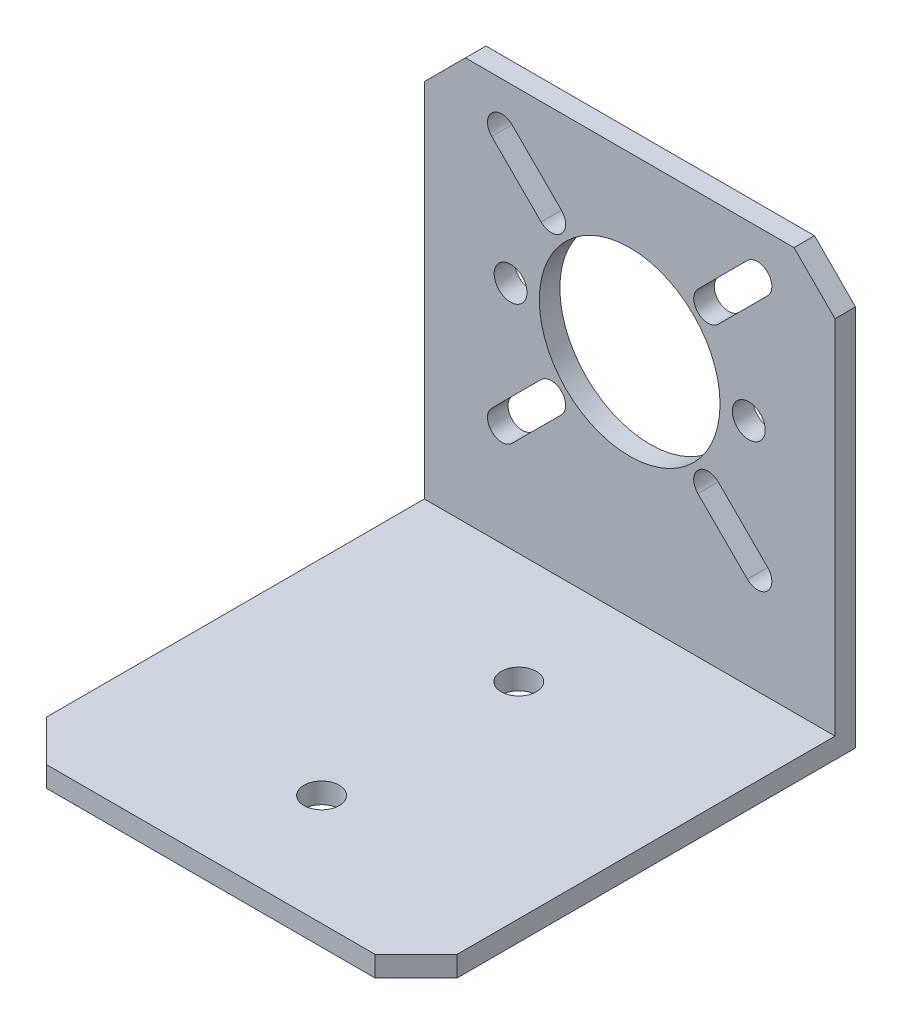
ISO-10303-21;
HEADER;
FILE_DESCRIPTION(('STEP AP214'),'2;1');
FILE_NAME('part.step','',(''),(''),'','','');
FILE_SCHEMA(('AUTOMOTIVE_DESIGN { 1 0 10303 214 1 1 1 1 }'));
ENDSEC;
DATA;
#1=APPLICATION_CONTEXT('core data for automotive mechanical design processes');
#2=APPLICATION_PROTOCOL_DEFINITION('international standard','automotive_design',2000,#1);
#3=PRODUCT_CONTEXT('',#1,'mechanical');
#4=PRODUCT('Part','Part','',(#3));
#5=PRODUCT_RELATED_PRODUCT_CATEGORY('part','',(#4));
#6=PRODUCT_DEFINITION_FORMATION('','',#4);
#7=PRODUCT_DEFINITION_CONTEXT('part definition',#1,'design');
#8=PRODUCT_DEFINITION('design','',#6,#7);
#9=PRODUCT_DEFINITION_SHAPE('','',#8);
#10=(LENGTH_UNIT() NAMED_UNIT(*) SI_UNIT(.MILLI.,.METRE.));
#11=(NAMED_UNIT(*) PLANE_ANGLE_UNIT() SI_UNIT($,.RADIAN.));
#12=(NAMED_UNIT(*) SI_UNIT($,.STERADIAN.) SOLID_ANGLE_UNIT());
#13=UNCERTAINTY_MEASURE_WITH_UNIT(LENGTH_MEASURE(1.E-05),#10,'distance_accuracy_value','');
#14=(GEOMETRIC_REPRESENTATION_CONTEXT(3) GLOBAL_UNCERTAINTY_ASSIGNED_CONTEXT((#13)) GLOBAL_UNIT_ASSIGNED_CONTEXT((#10,
#11,#12)) REPRESENTATION_CONTEXT('',''));
#15=CARTESIAN_POINT('',(0.,0.,0.));
#16=DIRECTION('',(0.,0.,1.));
#17=DIRECTION('',(1.,0.,0.));
#18=AXIS2_PLACEMENT_3D('',#15,#16,#17);
#19=CARTESIAN_POINT('',(0.,0.,2.5));
#20=DIRECTION('',(0.,0.,1.));
#21=DIRECTION('',(1.,0.,0.));
#22=AXIS2_PLACEMENT_3D('',#19,#20,#21);
#23=PLANE('',#22);
#24=DIRECTION('',(-1.,0.,0.));
#25=VECTOR('',#24,1.);
#26=CARTESIAN_POINT('',(-25.,25.75,2.5));
#27=LINE('',#26,#25);
#28=CARTESIAN_POINT('',(20.,25.75,2.5));
#29=VERTEX_POINT('',#28);
#30=CARTESIAN_POINT('',(-20.,25.75,2.5));
#31=VERTEX_POINT('',#30);
#32=EDGE_CURVE('E234',#29,#31,#27,.T.);
#33=ORIENTED_EDGE('',*,*,#32,.T.);
#34=DIRECTION('',(0.707106781186549,0.707106781186546,0.));
#35=VECTOR('',#34,1.);
#36=CARTESIAN_POINT('',(-22.8749999999999,22.8750000000001,2.5));
#37=LINE('',#36,#35);
#38=CARTESIAN_POINT('',(-25.,20.75,2.5));
#39=VERTEX_POINT('',#38);
#40=EDGE_CURVE('E228',#31,#39,#37,.F.);
#41=ORIENTED_EDGE('',*,*,#40,.T.);
#42=DIRECTION('',(0.,-1.,0.));
#43=VECTOR('',#42,1.);
#44=CARTESIAN_POINT('',(-25.,25.75,2.5));
#45=LINE('',#44,#43);
#46=CARTESIAN_POINT('',(-25.,-23.25,2.5));
#47=VERTEX_POINT('',#46);
#48=EDGE_CURVE('E219',#39,#47,#45,.T.);
#49=ORIENTED_EDGE('',*,*,#48,.T.);
#50=DIRECTION('',(-1.,0.,0.));
#51=VECTOR('',#50,1.);
#52=CARTESIAN_POINT('',(-25.,-23.25,2.5));
#53=LINE('',#52,#51);
#54=CARTESIAN_POINT('',(25.,-23.25,2.5));
#55=VERTEX_POINT('',#54);
#56=EDGE_CURVE('E225',#55,#47,#53,.T.);
#57=ORIENTED_EDGE('',*,*,#56,.F.);
#58=DIRECTION('',(0.,1.,0.));
#59=VECTOR('',#58,1.);
#60=CARTESIAN_POINT('',(25.,25.75,2.5));
#61=LINE('',#60,#59);
#62=CARTESIAN_POINT('',(25.,20.75,2.5));
#63=VERTEX_POINT('',#62);
#64=EDGE_CURVE('E461',#55,#63,#61,.T.);
#65=ORIENTED_EDGE('',*,*,#64,.T.);
#66=DIRECTION('',(0.707106781186547,-0.707106781186549,0.));
#67=VECTOR('',#66,1.);
#68=CARTESIAN_POINT('',(22.875,22.875,2.5));
#69=LINE('',#68,#67);
#70=EDGE_CURVE('E504',#63,#29,#69,.F.);
#71=ORIENTED_EDGE('',*,*,#70,.T.);
#72=EDGE_LOOP('',(#33,#41,#49,#57,#65,#71));
#73=FACE_BOUND('',#72,.T.);
#74=CARTESIAN_POINT('',(-14.5,4.74999999999999,2.5));
#75=DIRECTION('',(0.,0.,1.));
#76=DIRECTION('',(1.,0.,0.));
#77=AXIS2_PLACEMENT_3D('',#74,#75,#76);
#78=CIRCLE('',#77,2.);
#79=CARTESIAN_POINT('',(-12.5,4.74999999999999,2.5));
#80=VERTEX_POINT('',#79);
#81=EDGE_CURVE('E445',#80,#80,#78,.T.);
#82=ORIENTED_EDGE('',*,*,#81,.F.);
#83=EDGE_LOOP('',(#82));
#84=FACE_BOUND('',#83,.T.);
#85=CARTESIAN_POINT('',(0.,4.75,2.5));
#86=DIRECTION('',(0.,0.,1.));
#87=DIRECTION('',(1.,0.,0.));
#88=AXIS2_PLACEMENT_3D('',#85,#86,#87);
#89=CIRCLE('',#88,11.);
#90=CARTESIAN_POINT('',(11.,4.75,2.5));
#91=VERTEX_POINT('',#90);
#92=EDGE_CURVE('E453',#91,#91,#89,.T.);
#93=ORIENTED_EDGE('',*,*,#92,.F.);
#94=EDGE_LOOP('',(#93));
#95=FACE_BOUND('',#94,.T.);
#96=CARTESIAN_POINT('',(14.5,4.75,2.5));
#97=DIRECTION('',(0.,0.,1.));
#98=DIRECTION('',(1.,0.,0.));
#99=AXIS2_PLACEMENT_3D('',#96,#97,#98);
#100=CIRCLE('',#99,2.);
#101=CARTESIAN_POINT('',(16.5,4.75,2.5));
#102=VERTEX_POINT('',#101);
#103=EDGE_CURVE('E437',#102,#102,#100,.T.);
#104=ORIENTED_EDGE('',*,*,#103,.F.);
#105=EDGE_LOOP('',(#104));
#106=FACE_BOUND('',#105,.T.);
#107=DIRECTION('',(0.707106781186553,-0.707106781186542,0.));
#108=VECTOR('',#107,1.);
#109=CARTESIAN_POINT('',(-16.7937860531806,19.0689123190275,2.5));
#110=LINE('',#109,#108);
#111=CARTESIAN_POINT('',(-16.7937860531806,19.0689123190275,2.5));
#112=VERTEX_POINT('',#111);
#113=CARTESIAN_POINT('',(-10.7833784130949,13.0585046789419,2.5));
#114=VERTEX_POINT('',#113);
#115=EDGE_CURVE('E397',#112,#114,#110,.T.);
#116=ORIENTED_EDGE('',*,*,#115,.F.);
#117=CARTESIAN_POINT('',(-15.5563491861041,20.306349186104,2.5));
#118=DIRECTION('',(0.,0.,1.));
#119=DIRECTION('',(1.,0.,0.));
#120=AXIS2_PLACEMENT_3D('',#117,#118,#119);
#121=CIRCLE('',#120,1.74999999999998);
#122=CARTESIAN_POINT('',(-14.3189123190277,21.5437860531804,2.5));
#123=VERTEX_POINT('',#122);
#124=EDGE_CURVE('E394',#123,#112,#121,.T.);
#125=ORIENTED_EDGE('',*,*,#124,.F.);
#126=DIRECTION('',(-0.707106781186551,0.707106781186544,0.));
#127=VECTOR('',#126,1.);
#128=CARTESIAN_POINT('',(-14.3189123190277,21.5437860531804,2.5));
#129=LINE('',#128,#127);
#130=CARTESIAN_POINT('',(-8.30850467894202,15.5333784130948,2.5));
#131=VERTEX_POINT('',#130);
#132=EDGE_CURVE('E405',#131,#123,#129,.T.);
#133=ORIENTED_EDGE('',*,*,#132,.F.);
#134=CARTESIAN_POINT('',(-9.54594154601844,14.2959415460183,2.5));
#135=DIRECTION('',(0.,0.,1.));
#136=DIRECTION('',(1.,0.,0.));
#137=AXIS2_PLACEMENT_3D('',#134,#135,#136);
#138=CIRCLE('',#137,1.74999999999997);
#139=EDGE_CURVE('E401',#114,#131,#138,.T.);
#140=ORIENTED_EDGE('',*,*,#139,.F.);
#141=EDGE_LOOP('',(#116,#125,#133,#140));
#142=FACE_BOUND('',#141,.T.);
#143=DIRECTION('',(-0.70710678118655,-0.707106781186545,0.));
#144=VECTOR('',#143,1.);
#145=CARTESIAN_POINT('',(14.3189123190277,21.5437860531804,2.5));
#146=LINE('',#145,#144);
#147=CARTESIAN_POINT('',(14.3189123190277,21.5437860531804,2.5));
#148=VERTEX_POINT('',#147);
#149=CARTESIAN_POINT('',(8.30850467894203,15.5333784130948,2.5));
#150=VERTEX_POINT('',#149);
#151=EDGE_CURVE('E354',#148,#150,#146,.T.);
#152=ORIENTED_EDGE('',*,*,#151,.F.);
#153=CARTESIAN_POINT('',(15.5563491861041,20.306349186104,2.5));
#154=DIRECTION('',(0.,0.,1.));
#155=DIRECTION('',(-1.,0.,0.));
#156=AXIS2_PLACEMENT_3D('',#153,#154,#155);
#157=CIRCLE('',#156,1.74999999999998);
#158=CARTESIAN_POINT('',(16.7937860531806,19.0689123190275,2.5));
#159=VERTEX_POINT('',#158);
#160=EDGE_CURVE('E351',#159,#148,#157,.T.);
#161=ORIENTED_EDGE('',*,*,#160,.F.);
#162=DIRECTION('',(0.707106781186552,0.707106781186543,0.));
#163=VECTOR('',#162,1.);
#164=CARTESIAN_POINT('',(16.7937860531806,19.0689123190275,2.5));
#165=LINE('',#164,#163);
#166=CARTESIAN_POINT('',(10.7833784130949,13.0585046789419,2.5));
#167=VERTEX_POINT('',#166);
#168=EDGE_CURVE('E362',#167,#159,#165,.T.);
#169=ORIENTED_EDGE('',*,*,#168,.F.);
#170=CARTESIAN_POINT('',(9.54594154601845,14.2959415460183,2.5));
#171=DIRECTION('',(0.,0.,1.));
#172=DIRECTION('',(-1.,0.,0.));
#173=AXIS2_PLACEMENT_3D('',#170,#171,#172);
#174=CIRCLE('',#173,1.74999999999997);
#175=EDGE_CURVE('E358',#150,#167,#174,.T.);
#176=ORIENTED_EDGE('',*,*,#175,.F.);
#177=EDGE_LOOP('',(#152,#161,#169,#176));
#178=FACE_BOUND('',#177,.T.);
#179=DIRECTION('',(0.707106781186551,0.707106781186544,0.));
#180=VECTOR('',#179,1.);
#181=CARTESIAN_POINT('',(-14.3189123190277,-12.0437860531804,2.5));
#182=LINE('',#181,#180);
#183=CARTESIAN_POINT('',(-14.3189123190277,-12.0437860531804,2.5));
#184=VERTEX_POINT('',#183);
#185=CARTESIAN_POINT('',(-8.30850467894202,-6.03337841309478,2.5));
#186=VERTEX_POINT('',#185);
#187=EDGE_CURVE('E311',#184,#186,#182,.T.);
#188=ORIENTED_EDGE('',*,*,#187,.F.);
#189=CARTESIAN_POINT('',(-15.5563491861041,-10.806349186104,2.5));
#190=DIRECTION('',(0.,0.,1.));
#191=DIRECTION('',(-1.,0.,0.));
#192=AXIS2_PLACEMENT_3D('',#189,#190,#191);
#193=CIRCLE('',#192,1.74999999999998);
#194=CARTESIAN_POINT('',(-16.7937860531806,-9.56891231902749,2.5));
#195=VERTEX_POINT('',#194);
#196=EDGE_CURVE('E308',#195,#184,#193,.T.);
#197=ORIENTED_EDGE('',*,*,#196,.F.);
#198=DIRECTION('',(-0.707106781186553,-0.707106781186542,0.));
#199=VECTOR('',#198,1.);
#200=CARTESIAN_POINT('',(-16.7937860531806,-9.56891231902749,2.5));
#201=LINE('',#200,#199);
#202=CARTESIAN_POINT('',(-10.7833784130949,-3.55850467894189,2.5));
#203=VERTEX_POINT('',#202);
#204=EDGE_CURVE('E319',#203,#195,#201,.T.);
#205=ORIENTED_EDGE('',*,*,#204,.F.);
#206=CARTESIAN_POINT('',(-9.54594154601844,-4.79594154601834,2.5));
#207=DIRECTION('',(0.,0.,1.));
#208=DIRECTION('',(-1.,0.,0.));
#209=AXIS2_PLACEMENT_3D('',#206,#207,#208);
#210=CIRCLE('',#209,1.74999999999997);
#211=EDGE_CURVE('E315',#186,#203,#210,.T.);
#212=ORIENTED_EDGE('',*,*,#211,.F.);
#213=EDGE_LOOP('',(#188,#197,#205,#212));
#214=FACE_BOUND('',#213,.T.);
#215=DIRECTION('',(-0.707106781186552,0.707106781186543,0.));
#216=VECTOR('',#215,1.);
#217=CARTESIAN_POINT('',(16.7937860531806,-9.5689123190275,2.5));
#218=LINE('',#217,#216);
#219=CARTESIAN_POINT('',(16.7937860531806,-9.5689123190275,2.5));
#220=VERTEX_POINT('',#219);
#221=CARTESIAN_POINT('',(10.7833784130949,-3.55850467894189,2.5));
#222=VERTEX_POINT('',#221);
#223=EDGE_CURVE('E268',#220,#222,#218,.T.);
#224=ORIENTED_EDGE('',*,*,#223,.F.);
#225=CARTESIAN_POINT('',(15.5563491861041,-10.806349186104,2.5));
#226=DIRECTION('',(0.,0.,1.));
#227=DIRECTION('',(1.,0.,0.));
#228=AXIS2_PLACEMENT_3D('',#225,#226,#227);
#229=CIRCLE('',#228,1.74999999999998);
#230=CARTESIAN_POINT('',(14.3189123190277,-12.0437860531804,2.5));
#231=VERTEX_POINT('',#230);
#232=EDGE_CURVE('E265',#231,#220,#229,.T.);
#233=ORIENTED_EDGE('',*,*,#232,.F.);
#234=DIRECTION('',(0.70710678118655,-0.707106781186545,0.));
#235=VECTOR('',#234,1.);
#236=CARTESIAN_POINT('',(14.3189123190277,-12.0437860531804,2.5));
#237=LINE('',#236,#235);
#238=CARTESIAN_POINT('',(8.30850467894203,-6.03337841309478,2.5));
#239=VERTEX_POINT('',#238);
#240=EDGE_CURVE('E276',#239,#231,#237,.T.);
#241=ORIENTED_EDGE('',*,*,#240,.F.);
#242=CARTESIAN_POINT('',(9.54594154601845,-4.79594154601834,2.5));
#243=DIRECTION('',(0.,0.,1.));
#244=DIRECTION('',(1.,0.,0.));
#245=AXIS2_PLACEMENT_3D('',#242,#243,#244);
#246=CIRCLE('',#245,1.74999999999997);
#247=EDGE_CURVE('E272',#222,#239,#246,.T.);
#248=ORIENTED_EDGE('',*,*,#247,.F.);
#249=EDGE_LOOP('',(#224,#233,#241,#248));
#250=FACE_BOUND('',#249,.T.);
#251=ADVANCED_FACE('F43',(#73,#84,#95,#106,#142,#178,#214,#250),#23,.T.);
#252=CARTESIAN_POINT('',(0.,0.,0.));
#253=DIRECTION('',(0.,0.,1.));
#254=DIRECTION('',(1.,0.,0.));
#255=AXIS2_PLACEMENT_3D('',#252,#253,#254);
#256=PLANE('',#255);
#257=CARTESIAN_POINT('',(-15.5563491861041,-10.806349186104,0.));
#258=DIRECTION('',(0.,0.,1.));
#259=DIRECTION('',(-1.,0.,0.));
#260=AXIS2_PLACEMENT_3D('',#257,#258,#259);
#261=CIRCLE('',#260,1.74999999999998);
#262=CARTESIAN_POINT('',(-16.7937860531806,-9.56891231902749,0.));
#263=VERTEX_POINT('',#262);
#264=CARTESIAN_POINT('',(-14.3189123190277,-12.0437860531804,0.));
#265=VERTEX_POINT('',#264);
#266=EDGE_CURVE('E307',#263,#265,#261,.T.);
#267=ORIENTED_EDGE('',*,*,#266,.T.);
#268=DIRECTION('',(0.707106781186551,0.707106781186544,0.));
#269=VECTOR('',#268,1.);
#270=CARTESIAN_POINT('',(-14.3189123190277,-12.0437860531804,0.));
#271=LINE('',#270,#269);
#272=CARTESIAN_POINT('',(-8.30850467894202,-6.03337841309478,0.));
#273=VERTEX_POINT('',#272);
#274=EDGE_CURVE('E326',#265,#273,#271,.T.);
#275=ORIENTED_EDGE('',*,*,#274,.T.);
#276=CARTESIAN_POINT('',(-9.54594154601844,-4.79594154601834,0.));
#277=DIRECTION('',(0.,0.,1.));
#278=DIRECTION('',(-1.,0.,0.));
#279=AXIS2_PLACEMENT_3D('',#276,#277,#278);
#280=CIRCLE('',#279,1.74999999999997);
#281=CARTESIAN_POINT('',(-10.7833784130949,-3.55850467894189,0.));
#282=VERTEX_POINT('',#281);
#283=EDGE_CURVE('E330',#273,#282,#280,.T.);
#284=ORIENTED_EDGE('',*,*,#283,.T.);
#285=DIRECTION('',(-0.707106781186553,-0.707106781186542,0.));
#286=VECTOR('',#285,1.);
#287=CARTESIAN_POINT('',(-16.7937860531806,-9.56891231902749,0.));
#288=LINE('',#287,#286);
#289=EDGE_CURVE('E312',#282,#263,#288,.T.);
#290=ORIENTED_EDGE('',*,*,#289,.T.);
#291=EDGE_LOOP('',(#267,#275,#284,#290));
#292=FACE_BOUND('',#291,.T.);
#293=CARTESIAN_POINT('',(-15.5563491861041,20.306349186104,0.));
#294=DIRECTION('',(0.,0.,1.));
#295=DIRECTION('',(1.,0.,0.));
#296=AXIS2_PLACEMENT_3D('',#293,#294,#295);
#297=CIRCLE('',#296,1.74999999999998);
#298=CARTESIAN_POINT('',(-14.3189123190277,21.5437860531804,0.));
#299=VERTEX_POINT('',#298);
#300=CARTESIAN_POINT('',(-16.7937860531806,19.0689123190275,0.));
#301=VERTEX_POINT('',#300);
#302=EDGE_CURVE('E393',#299,#301,#297,.T.);
#303=ORIENTED_EDGE('',*,*,#302,.T.);
#304=DIRECTION('',(0.707106781186553,-0.707106781186542,0.));
#305=VECTOR('',#304,1.);
#306=CARTESIAN_POINT('',(-16.7937860531806,19.0689123190275,0.));
#307=LINE('',#306,#305);
#308=CARTESIAN_POINT('',(-10.7833784130949,13.0585046789419,0.));
#309=VERTEX_POINT('',#308);
#310=EDGE_CURVE('E412',#301,#309,#307,.T.);
#311=ORIENTED_EDGE('',*,*,#310,.T.);
#312=CARTESIAN_POINT('',(-9.54594154601844,14.2959415460183,0.));
#313=DIRECTION('',(0.,0.,1.));
#314=DIRECTION('',(1.,0.,0.));
#315=AXIS2_PLACEMENT_3D('',#312,#313,#314);
#316=CIRCLE('',#315,1.74999999999997);
#317=CARTESIAN_POINT('',(-8.30850467894202,15.5333784130948,0.));
#318=VERTEX_POINT('',#317);
#319=EDGE_CURVE('E416',#309,#318,#316,.T.);
#320=ORIENTED_EDGE('',*,*,#319,.T.);
#321=DIRECTION('',(-0.707106781186551,0.707106781186544,0.));
#322=VECTOR('',#321,1.);
#323=CARTESIAN_POINT('',(-14.3189123190277,21.5437860531804,0.));
#324=LINE('',#323,#322);
#325=EDGE_CURVE('E398',#318,#299,#324,.T.);
#326=ORIENTED_EDGE('',*,*,#325,.T.);
#327=EDGE_LOOP('',(#303,#311,#320,#326));
#328=FACE_BOUND('',#327,.T.);
#329=DIRECTION('',(0.,-1.,0.));
#330=VECTOR('',#329,1.);
#331=CARTESIAN_POINT('',(-25.,25.75,0.));
#332=LINE('',#331,#330);
#333=CARTESIAN_POINT('',(-25.,20.75,0.));
#334=VERTEX_POINT('',#333);
#335=CARTESIAN_POINT('',(-25.,-25.75,0.));
#336=VERTEX_POINT('',#335);
#337=EDGE_CURVE('E474',#334,#336,#332,.T.);
#338=ORIENTED_EDGE('',*,*,#337,.F.);
#339=DIRECTION('',(-0.707106781186549,-0.707106781186546,0.));
#340=VECTOR('',#339,1.);
#341=CARTESIAN_POINT('',(-25.,20.75,0.));
#342=LINE('',#341,#340);
#343=CARTESIAN_POINT('',(-20.,25.75,0.));
#344=VERTEX_POINT('',#343);
#345=EDGE_CURVE('E494',#334,#344,#342,.F.);
#346=ORIENTED_EDGE('',*,*,#345,.T.);
#347=DIRECTION('',(-1.,0.,0.));
#348=VECTOR('',#347,1.);
#349=CARTESIAN_POINT('',(-25.,25.75,0.));
#350=LINE('',#349,#348);
#351=CARTESIAN_POINT('',(20.,25.75,0.));
#352=VERTEX_POINT('',#351);
#353=EDGE_CURVE('E470',#352,#344,#350,.T.);
#354=ORIENTED_EDGE('',*,*,#353,.F.);
#355=DIRECTION('',(-0.707106781186547,0.707106781186549,0.));
#356=VECTOR('',#355,1.);
#357=CARTESIAN_POINT('',(20.,25.75,0.));
#358=LINE('',#357,#356);
#359=CARTESIAN_POINT('',(25.,20.75,0.));
#360=VERTEX_POINT('',#359);
#361=EDGE_CURVE('E491',#352,#360,#358,.F.);
#362=ORIENTED_EDGE('',*,*,#361,.T.);
#363=DIRECTION('',(0.,1.,0.));
#364=VECTOR('',#363,1.);
#365=CARTESIAN_POINT('',(25.,25.75,0.));
#366=LINE('',#365,#364);
#367=CARTESIAN_POINT('',(25.,-25.75,0.));
#368=VERTEX_POINT('',#367);
#369=EDGE_CURVE('E457',#368,#360,#366,.T.);
#370=ORIENTED_EDGE('',*,*,#369,.F.);
#371=DIRECTION('',(1.,0.,0.));
#372=VECTOR('',#371,1.);
#373=CARTESIAN_POINT('',(-25.,-25.75,0.));
#374=LINE('',#373,#372);
#375=EDGE_CURVE('E464',#336,#368,#374,.T.);
#376=ORIENTED_EDGE('',*,*,#375,.F.);
#377=EDGE_LOOP('',(#338,#346,#354,#362,#370,#376));
#378=FACE_BOUND('',#377,.T.);
#379=CARTESIAN_POINT('',(0.,4.75,0.));
#380=DIRECTION('',(0.,0.,1.));
#381=DIRECTION('',(1.,0.,0.));
#382=AXIS2_PLACEMENT_3D('',#379,#380,#381);
#383=CIRCLE('',#382,11.);
#384=CARTESIAN_POINT('',(11.,4.75,0.));
#385=VERTEX_POINT('',#384);
#386=EDGE_CURVE('E449',#385,#385,#383,.T.);
#387=ORIENTED_EDGE('',*,*,#386,.T.);
#388=EDGE_LOOP('',(#387));
#389=FACE_BOUND('',#388,.T.);
#390=CARTESIAN_POINT('',(-14.5,4.74999999999999,0.));
#391=DIRECTION('',(0.,0.,1.));
#392=DIRECTION('',(1.,0.,0.));
#393=AXIS2_PLACEMENT_3D('',#390,#391,#392);
#394=CIRCLE('',#393,2.);
#395=CARTESIAN_POINT('',(-12.5,4.74999999999999,0.));
#396=VERTEX_POINT('',#395);
#397=EDGE_CURVE('E441',#396,#396,#394,.T.);
#398=ORIENTED_EDGE('',*,*,#397,.T.);
#399=EDGE_LOOP('',(#398));
#400=FACE_BOUND('',#399,.T.);
#401=CARTESIAN_POINT('',(14.5,4.75,0.));
#402=DIRECTION('',(0.,0.,1.));
#403=DIRECTION('',(1.,0.,0.));
#404=AXIS2_PLACEMENT_3D('',#401,#402,#403);
#405=CIRCLE('',#404,2.);
#406=CARTESIAN_POINT('',(16.5,4.75,0.));
#407=VERTEX_POINT('',#406);
#408=EDGE_CURVE('E436',#407,#407,#405,.T.);
#409=ORIENTED_EDGE('',*,*,#408,.T.);
#410=EDGE_LOOP('',(#409));
#411=FACE_BOUND('',#410,.T.);
#412=CARTESIAN_POINT('',(15.5563491861041,20.306349186104,0.));
#413=DIRECTION('',(0.,0.,1.));
#414=DIRECTION('',(-1.,0.,0.));
#415=AXIS2_PLACEMENT_3D('',#412,#413,#414);
#416=CIRCLE('',#415,1.74999999999998);
#417=CARTESIAN_POINT('',(16.7937860531806,19.0689123190275,0.));
#418=VERTEX_POINT('',#417);
#419=CARTESIAN_POINT('',(14.3189123190277,21.5437860531804,0.));
#420=VERTEX_POINT('',#419);
#421=EDGE_CURVE('E350',#418,#420,#416,.T.);
#422=ORIENTED_EDGE('',*,*,#421,.T.);
#423=DIRECTION('',(-0.70710678118655,-0.707106781186545,0.));
#424=VECTOR('',#423,1.);
#425=CARTESIAN_POINT('',(14.3189123190277,21.5437860531804,0.));
#426=LINE('',#425,#424);
#427=CARTESIAN_POINT('',(8.30850467894203,15.5333784130948,0.));
#428=VERTEX_POINT('',#427);
#429=EDGE_CURVE('E369',#420,#428,#426,.T.);
#430=ORIENTED_EDGE('',*,*,#429,.T.);
#431=CARTESIAN_POINT('',(9.54594154601845,14.2959415460183,0.));
#432=DIRECTION('',(0.,0.,1.));
#433=DIRECTION('',(-1.,0.,0.));
#434=AXIS2_PLACEMENT_3D('',#431,#432,#433);
#435=CIRCLE('',#434,1.74999999999997);
#436=CARTESIAN_POINT('',(10.7833784130949,13.0585046789419,0.));
#437=VERTEX_POINT('',#436);
#438=EDGE_CURVE('E373',#428,#437,#435,.T.);
#439=ORIENTED_EDGE('',*,*,#438,.T.);
#440=DIRECTION('',(0.707106781186552,0.707106781186543,0.));
#441=VECTOR('',#440,1.);
#442=CARTESIAN_POINT('',(16.7937860531806,19.0689123190275,0.));
#443=LINE('',#442,#441);
#444=EDGE_CURVE('E355',#437,#418,#443,.T.);
#445=ORIENTED_EDGE('',*,*,#444,.T.);
#446=EDGE_LOOP('',(#422,#430,#439,#445));
#447=FACE_BOUND('',#446,.T.);
#448=CARTESIAN_POINT('',(15.5563491861041,-10.806349186104,0.));
#449=DIRECTION('',(0.,0.,1.));
#450=DIRECTION('',(1.,0.,0.));
#451=AXIS2_PLACEMENT_3D('',#448,#449,#450);
#452=CIRCLE('',#451,1.74999999999998);
#453=CARTESIAN_POINT('',(14.3189123190277,-12.0437860531804,0.));
#454=VERTEX_POINT('',#453);
#455=CARTESIAN_POINT('',(16.7937860531806,-9.5689123190275,0.));
#456=VERTEX_POINT('',#455);
#457=EDGE_CURVE('E263',#454,#456,#452,.T.);
#458=ORIENTED_EDGE('',*,*,#457,.T.);
#459=DIRECTION('',(-0.707106781186552,0.707106781186543,0.));
#460=VECTOR('',#459,1.);
#461=CARTESIAN_POINT('',(16.7937860531806,-9.5689123190275,0.));
#462=LINE('',#461,#460);
#463=CARTESIAN_POINT('',(10.7833784130949,-3.55850467894189,0.));
#464=VERTEX_POINT('',#463);
#465=EDGE_CURVE('E283',#456,#464,#462,.T.);
#466=ORIENTED_EDGE('',*,*,#465,.T.);
#467=CARTESIAN_POINT('',(9.54594154601845,-4.79594154601834,0.));
#468=DIRECTION('',(0.,0.,1.));
#469=DIRECTION('',(1.,0.,0.));
#470=AXIS2_PLACEMENT_3D('',#467,#468,#469);
#471=CIRCLE('',#470,1.74999999999997);
#472=CARTESIAN_POINT('',(8.30850467894203,-6.03337841309478,0.));
#473=VERTEX_POINT('',#472);
#474=EDGE_CURVE('E287',#464,#473,#471,.T.);
#475=ORIENTED_EDGE('',*,*,#474,.T.);
#476=DIRECTION('',(0.70710678118655,-0.707106781186545,0.));
#477=VECTOR('',#476,1.);
#478=CARTESIAN_POINT('',(14.3189123190277,-12.0437860531804,0.));
#479=LINE('',#478,#477);
#480=EDGE_CURVE('E269',#473,#454,#479,.T.);
#481=ORIENTED_EDGE('',*,*,#480,.T.);
#482=EDGE_LOOP('',(#458,#466,#475,#481));
#483=FACE_BOUND('',#482,.T.);
#484=ADVANCED_FACE('F548',(#292,#328,#378,#389,#400,#411,#447,#483),#256,.F.);
#485=CARTESIAN_POINT('',(25.,25.75,2.5));
#486=DIRECTION('',(-1.,0.,0.));
#487=DIRECTION('',(0.,0.,1.));
#488=AXIS2_PLACEMENT_3D('',#485,#486,#487);
#489=PLANE('',#488);
#490=ORIENTED_EDGE('',*,*,#369,.T.);
#491=DIRECTION('',(0.,0.,1.));
#492=VECTOR('',#491,1.);
#493=CARTESIAN_POINT('',(25.,20.75,2.5));
#494=LINE('',#493,#492);
#495=EDGE_CURVE('E512',#360,#63,#494,.T.);
#496=ORIENTED_EDGE('',*,*,#495,.T.);
#497=ORIENTED_EDGE('',*,*,#64,.F.);
#498=DIRECTION('',(0.,0.,-1.));
#499=VECTOR('',#498,1.);
#500=CARTESIAN_POINT('',(25.,-23.25,157.062460986252));
#501=LINE('',#500,#499);
#502=CARTESIAN_POINT('',(25.,-23.25,48.5));
#503=VERTEX_POINT('',#502);
#504=EDGE_CURVE('E244',#503,#55,#501,.T.);
#505=ORIENTED_EDGE('',*,*,#504,.F.);
#506=DIRECTION('',(0.,-1.,0.));
#507=VECTOR('',#506,1.);
#508=CARTESIAN_POINT('',(25.,-25.75,48.5));
#509=LINE('',#508,#507);
#510=CARTESIAN_POINT('',(25.,-25.75,48.5));
#511=VERTEX_POINT('',#510);
#512=EDGE_CURVE('E509',#503,#511,#509,.T.);
#513=ORIENTED_EDGE('',*,*,#512,.T.);
#514=DIRECTION('',(0.,0.,-1.));
#515=VECTOR('',#514,1.);
#516=CARTESIAN_POINT('',(25.,-25.75,2.5));
#517=LINE('',#516,#515);
#518=EDGE_CURVE('E233',#511,#368,#517,.T.);
#519=ORIENTED_EDGE('',*,*,#518,.T.);
#520=EDGE_LOOP('',(#490,#496,#497,#505,#513,#519));
#521=FACE_BOUND('',#520,.T.);
#522=ADVANCED_FACE('F531',(#521),#489,.F.);
#523=CARTESIAN_POINT('',(-25.,25.75,2.5));
#524=DIRECTION('',(0.,-1.,0.));
#525=DIRECTION('',(0.,0.,-1.));
#526=AXIS2_PLACEMENT_3D('',#523,#524,#525);
#527=PLANE('',#526);
#528=ORIENTED_EDGE('',*,*,#353,.T.);
#529=DIRECTION('',(0.,0.,1.));
#530=VECTOR('',#529,1.);
#531=CARTESIAN_POINT('',(-20.,25.75,2.5));
#532=LINE('',#531,#530);
#533=EDGE_CURVE('E501',#344,#31,#532,.T.);
#534=ORIENTED_EDGE('',*,*,#533,.T.);
#535=ORIENTED_EDGE('',*,*,#32,.F.);
#536=DIRECTION('',(0.,0.,-1.));
#537=VECTOR('',#536,1.);
#538=CARTESIAN_POINT('',(20.,25.75,2.5));
#539=LINE('',#538,#537);
#540=EDGE_CURVE('E497',#29,#352,#539,.T.);
#541=ORIENTED_EDGE('',*,*,#540,.T.);
#542=EDGE_LOOP('',(#528,#534,#535,#541));
#543=FACE_BOUND('',#542,.T.);
#544=ADVANCED_FACE('F564',(#543),#527,.F.);
#545=CARTESIAN_POINT('',(-25.,25.75,2.5));
#546=DIRECTION('',(1.,0.,0.));
#547=DIRECTION('',(0.,1.,0.));
#548=AXIS2_PLACEMENT_3D('',#545,#546,#547);
#549=PLANE('',#548);
#550=ORIENTED_EDGE('',*,*,#48,.F.);
#551=DIRECTION('',(0.,0.,-1.));
#552=VECTOR('',#551,1.);
#553=CARTESIAN_POINT('',(-25.,20.75,2.5));
#554=LINE('',#553,#552);
#555=EDGE_CURVE('E488',#39,#334,#554,.T.);
#556=ORIENTED_EDGE('',*,*,#555,.T.);
#557=ORIENTED_EDGE('',*,*,#337,.T.);
#558=DIRECTION('',(0.,0.,-1.));
#559=VECTOR('',#558,1.);
#560=CARTESIAN_POINT('',(-25.,-25.75,2.5));
#561=LINE('',#560,#559);
#562=CARTESIAN_POINT('',(-25.,-25.75,48.5));
#563=VERTEX_POINT('',#562);
#564=EDGE_CURVE('E483',#563,#336,#561,.T.);
#565=ORIENTED_EDGE('',*,*,#564,.F.);
#566=DIRECTION('',(0.,1.,0.));
#567=VECTOR('',#566,1.);
#568=CARTESIAN_POINT('',(-25.,-23.25,48.5));
#569=LINE('',#568,#567);
#570=CARTESIAN_POINT('',(-25.,-23.25,48.5));
#571=VERTEX_POINT('',#570);
#572=EDGE_CURVE('E240',#563,#571,#569,.T.);
#573=ORIENTED_EDGE('',*,*,#572,.T.);
#574=DIRECTION('',(0.,0.,-1.));
#575=VECTOR('',#574,1.);
#576=CARTESIAN_POINT('',(-25.,-23.25,157.062460986252));
#577=LINE('',#576,#575);
#578=EDGE_CURVE('E237',#571,#47,#577,.T.);
#579=ORIENTED_EDGE('',*,*,#578,.T.);
#580=EDGE_LOOP('',(#550,#556,#557,#565,#573,#579));
#581=FACE_BOUND('',#580,.T.);
#582=ADVANCED_FACE('F238',(#581),#549,.F.);
#583=CARTESIAN_POINT('',(-25.,-25.75,2.5));
#584=DIRECTION('',(0.,1.,0.));
#585=DIRECTION('',(0.,0.,1.));
#586=AXIS2_PLACEMENT_3D('',#583,#584,#585);
#587=PLANE('',#586);
#588=CARTESIAN_POINT('',(0.,-25.75,40.));
#589=DIRECTION('',(0.,1.,0.));
#590=DIRECTION('',(0.,0.,1.));
#591=AXIS2_PLACEMENT_3D('',#588,#589,#590);
#592=CIRCLE('',#591,2.14999999999998);
#593=CARTESIAN_POINT('',(0.,-25.75,42.15));
#594=VERTEX_POINT('',#593);
#595=EDGE_CURVE('E245',#594,#594,#592,.T.);
#596=ORIENTED_EDGE('',*,*,#595,.T.);
#597=EDGE_LOOP('',(#596));
#598=FACE_BOUND('',#597,.T.);
#599=CARTESIAN_POINT('',(0.,-25.75,16.));
#600=DIRECTION('',(0.,1.,0.));
#601=DIRECTION('',(0.,0.,1.));
#602=AXIS2_PLACEMENT_3D('',#599,#600,#601);
#603=CIRCLE('',#602,2.14999999999998);
#604=CARTESIAN_POINT('',(0.,-25.75,18.15));
#605=VERTEX_POINT('',#604);
#606=EDGE_CURVE('E934',#605,#605,#603,.T.);
#607=ORIENTED_EDGE('',*,*,#606,.T.);
#608=EDGE_LOOP('',(#607));
#609=FACE_BOUND('',#608,.T.);
#610=DIRECTION('',(1.,0.,0.));
#611=VECTOR('',#610,1.);
#612=CARTESIAN_POINT('',(-25.,-25.75,53.5));
#613=LINE('',#612,#611);
#614=CARTESIAN_POINT('',(-20.,-25.75,53.5));
#615=VERTEX_POINT('',#614);
#616=CARTESIAN_POINT('',(20.,-25.75,53.5));
#617=VERTEX_POINT('',#616);
#618=EDGE_CURVE('E255',#615,#617,#613,.T.);
#619=ORIENTED_EDGE('',*,*,#618,.F.);
#620=DIRECTION('',(-0.707106781186547,0.,-0.707106781186549));
#621=VECTOR('',#620,1.);
#622=CARTESIAN_POINT('',(-20.,-25.75,53.5));
#623=LINE('',#622,#621);
#624=EDGE_CURVE('E67',#615,#563,#623,.T.);
#625=ORIENTED_EDGE('',*,*,#624,.T.);
#626=ORIENTED_EDGE('',*,*,#564,.T.);
#627=ORIENTED_EDGE('',*,*,#375,.T.);
#628=ORIENTED_EDGE('',*,*,#518,.F.);
#629=DIRECTION('',(-0.707106781186547,0.,0.707106781186549));
#630=VECTOR('',#629,1.);
#631=CARTESIAN_POINT('',(20.,-25.75,53.5));
#632=LINE('',#631,#630);
#633=EDGE_CURVE('E59',#511,#617,#632,.T.);
#634=ORIENTED_EDGE('',*,*,#633,.T.);
#635=EDGE_LOOP('',(#619,#625,#626,#627,#628,#634));
#636=FACE_BOUND('',#635,.T.);
#637=ADVANCED_FACE('F534',(#598,#609,#636),#587,.F.);
#638=CARTESIAN_POINT('',(0.,4.75,2.5));
#639=DIRECTION('',(0.,0.,-1.));
#640=DIRECTION('',(-1.,0.,0.));
#641=AXIS2_PLACEMENT_3D('',#638,#639,#640);
#642=CYLINDRICAL_SURFACE('',#641,11.);
#643=ORIENTED_EDGE('',*,*,#92,.T.);
#644=EDGE_LOOP('',(#643));
#645=FACE_BOUND('',#644,.T.);
#646=ORIENTED_EDGE('',*,*,#386,.F.);
#647=EDGE_LOOP('',(#646));
#648=FACE_BOUND('',#647,.T.);
#649=ADVANCED_FACE('F556',(#645,#648),#642,.F.);
#650=CARTESIAN_POINT('',(-14.5,4.74999999999999,2.5));
#651=DIRECTION('',(0.,0.,-1.));
#652=DIRECTION('',(-1.,0.,0.));
#653=AXIS2_PLACEMENT_3D('',#650,#651,#652);
#654=CYLINDRICAL_SURFACE('',#653,2.);
#655=ORIENTED_EDGE('',*,*,#81,.T.);
#656=EDGE_LOOP('',(#655));
#657=FACE_BOUND('',#656,.T.);
#658=ORIENTED_EDGE('',*,*,#397,.F.);
#659=EDGE_LOOP('',(#658));
#660=FACE_BOUND('',#659,.T.);
#661=ADVANCED_FACE('F675',(#657,#660),#654,.F.);
#662=CARTESIAN_POINT('',(14.5,4.75,2.5));
#663=DIRECTION('',(0.,0.,-1.));
#664=DIRECTION('',(-1.,0.,0.));
#665=AXIS2_PLACEMENT_3D('',#662,#663,#664);
#666=CYLINDRICAL_SURFACE('',#665,2.);
#667=ORIENTED_EDGE('',*,*,#103,.T.);
#668=EDGE_LOOP('',(#667));
#669=FACE_BOUND('',#668,.T.);
#670=ORIENTED_EDGE('',*,*,#408,.F.);
#671=EDGE_LOOP('',(#670));
#672=FACE_BOUND('',#671,.T.);
#673=ADVANCED_FACE('F672',(#669,#672),#666,.F.);
#674=CARTESIAN_POINT('',(-15.5563491861041,20.306349186104,2.5));
#675=DIRECTION('',(0.,0.,-1.));
#676=DIRECTION('',(-1.,0.,0.));
#677=AXIS2_PLACEMENT_3D('',#674,#675,#676);
#678=CYLINDRICAL_SURFACE('',#677,1.74999999999998);
#679=ORIENTED_EDGE('',*,*,#302,.F.);
#680=DIRECTION('',(0.,0.,-1.));
#681=VECTOR('',#680,1.);
#682=CARTESIAN_POINT('',(-14.3189123190277,21.5437860531804,2.5));
#683=LINE('',#682,#681);
#684=EDGE_CURVE('E408',#123,#299,#683,.T.);
#685=ORIENTED_EDGE('',*,*,#684,.F.);
#686=ORIENTED_EDGE('',*,*,#124,.T.);
#687=DIRECTION('',(0.,0.,-1.));
#688=VECTOR('',#687,1.);
#689=CARTESIAN_POINT('',(-16.7937860531806,19.0689123190275,2.5));
#690=LINE('',#689,#688);
#691=EDGE_CURVE('E432',#112,#301,#690,.T.);
#692=ORIENTED_EDGE('',*,*,#691,.T.);
#693=EDGE_LOOP('',(#679,#685,#686,#692));
#694=FACE_BOUND('',#693,.T.);
#695=ADVANCED_FACE('F668',(#694),#678,.F.);
#696=CARTESIAN_POINT('',(-16.7937860531806,19.0689123190275,2.5));
#697=DIRECTION('',(0.707106781186542,0.707106781186553,0.));
#698=DIRECTION('',(-0.707106781186553,0.707106781186542,0.));
#699=AXIS2_PLACEMENT_3D('',#696,#697,#698);
#700=PLANE('',#699);
#701=ORIENTED_EDGE('',*,*,#310,.F.);
#702=ORIENTED_EDGE('',*,*,#691,.F.);
#703=ORIENTED_EDGE('',*,*,#115,.T.);
#704=DIRECTION('',(0.,0.,-1.));
#705=VECTOR('',#704,1.);
#706=CARTESIAN_POINT('',(-10.7833784130949,13.0585046789419,2.5));
#707=LINE('',#706,#705);
#708=EDGE_CURVE('E429',#114,#309,#707,.T.);
#709=ORIENTED_EDGE('',*,*,#708,.T.);
#710=EDGE_LOOP('',(#701,#702,#703,#709));
#711=FACE_BOUND('',#710,.T.);
#712=ADVANCED_FACE('F664',(#711),#700,.T.);
#713=CARTESIAN_POINT('',(-9.54594154601844,14.2959415460183,2.5));
#714=DIRECTION('',(0.,0.,-1.));
#715=DIRECTION('',(-1.,0.,0.));
#716=AXIS2_PLACEMENT_3D('',#713,#714,#715);
#717=CYLINDRICAL_SURFACE('',#716,1.74999999999997);
#718=ORIENTED_EDGE('',*,*,#319,.F.);
#719=ORIENTED_EDGE('',*,*,#708,.F.);
#720=ORIENTED_EDGE('',*,*,#139,.T.);
#721=DIRECTION('',(0.,0.,-1.));
#722=VECTOR('',#721,1.);
#723=CARTESIAN_POINT('',(-8.30850467894202,15.5333784130948,2.5));
#724=LINE('',#723,#722);
#725=EDGE_CURVE('E426',#131,#318,#724,.T.);
#726=ORIENTED_EDGE('',*,*,#725,.T.);
#727=EDGE_LOOP('',(#718,#719,#720,#726));
#728=FACE_BOUND('',#727,.T.);
#729=ADVANCED_FACE('F660',(#728),#717,.F.);
#730=CARTESIAN_POINT('',(-14.3189123190277,21.5437860531804,2.5));
#731=DIRECTION('',(-0.707106781186544,-0.707106781186551,0.));
#732=DIRECTION('',(0.707106781186551,-0.707106781186544,0.));
#733=AXIS2_PLACEMENT_3D('',#730,#731,#732);
#734=PLANE('',#733);
#735=ORIENTED_EDGE('',*,*,#325,.F.);
#736=ORIENTED_EDGE('',*,*,#725,.F.);
#737=ORIENTED_EDGE('',*,*,#132,.T.);
#738=ORIENTED_EDGE('',*,*,#684,.T.);
#739=EDGE_LOOP('',(#735,#736,#737,#738));
#740=FACE_BOUND('',#739,.T.);
#741=ADVANCED_FACE('F656',(#740),#734,.T.);
#742=CARTESIAN_POINT('',(15.5563491861041,20.306349186104,2.5));
#743=DIRECTION('',(0.,0.,-1.));
#744=DIRECTION('',(-1.,0.,0.));
#745=AXIS2_PLACEMENT_3D('',#742,#743,#744);
#746=CYLINDRICAL_SURFACE('',#745,1.74999999999998);
#747=ORIENTED_EDGE('',*,*,#421,.F.);
#748=DIRECTION('',(0.,0.,-1.));
#749=VECTOR('',#748,1.);
#750=CARTESIAN_POINT('',(16.7937860531806,19.0689123190275,2.5));
#751=LINE('',#750,#749);
#752=EDGE_CURVE('E365',#159,#418,#751,.T.);
#753=ORIENTED_EDGE('',*,*,#752,.F.);
#754=ORIENTED_EDGE('',*,*,#160,.T.);
#755=DIRECTION('',(0.,0.,-1.));
#756=VECTOR('',#755,1.);
#757=CARTESIAN_POINT('',(14.3189123190277,21.5437860531804,2.5));
#758=LINE('',#757,#756);
#759=EDGE_CURVE('E389',#148,#420,#758,.T.);
#760=ORIENTED_EDGE('',*,*,#759,.T.);
#761=EDGE_LOOP('',(#747,#753,#754,#760));
#762=FACE_BOUND('',#761,.T.);
#763=ADVANCED_FACE('F652',(#762),#746,.F.);
#764=CARTESIAN_POINT('',(14.3189123190277,21.5437860531804,2.5));
#765=DIRECTION('',(0.707106781186545,-0.70710678118655,0.));
#766=DIRECTION('',(0.70710678118655,0.707106781186545,0.));
#767=AXIS2_PLACEMENT_3D('',#764,#765,#766);
#768=PLANE('',#767);
#769=ORIENTED_EDGE('',*,*,#429,.F.);
#770=ORIENTED_EDGE('',*,*,#759,.F.);
#771=ORIENTED_EDGE('',*,*,#151,.T.);
#772=DIRECTION('',(0.,0.,-1.));
#773=VECTOR('',#772,1.);
#774=CARTESIAN_POINT('',(8.30850467894203,15.5333784130948,2.5));
#775=LINE('',#774,#773);
#776=EDGE_CURVE('E386',#150,#428,#775,.T.);
#777=ORIENTED_EDGE('',*,*,#776,.T.);
#778=EDGE_LOOP('',(#769,#770,#771,#777));
#779=FACE_BOUND('',#778,.T.);
#780=ADVANCED_FACE('F648',(#779),#768,.T.);
#781=CARTESIAN_POINT('',(9.54594154601845,14.2959415460183,2.5));
#782=DIRECTION('',(0.,0.,-1.));
#783=DIRECTION('',(-1.,0.,0.));
#784=AXIS2_PLACEMENT_3D('',#781,#782,#783);
#785=CYLINDRICAL_SURFACE('',#784,1.74999999999997);
#786=ORIENTED_EDGE('',*,*,#438,.F.);
#787=ORIENTED_EDGE('',*,*,#776,.F.);
#788=ORIENTED_EDGE('',*,*,#175,.T.);
#789=DIRECTION('',(0.,0.,-1.));
#790=VECTOR('',#789,1.);
#791=CARTESIAN_POINT('',(10.7833784130949,13.0585046789419,2.5));
#792=LINE('',#791,#790);
#793=EDGE_CURVE('E383',#167,#437,#792,.T.);
#794=ORIENTED_EDGE('',*,*,#793,.T.);
#795=EDGE_LOOP('',(#786,#787,#788,#794));
#796=FACE_BOUND('',#795,.T.);
#797=ADVANCED_FACE('F644',(#796),#785,.F.);
#798=CARTESIAN_POINT('',(16.7937860531806,19.0689123190275,2.5));
#799=DIRECTION('',(-0.707106781186543,0.707106781186552,0.));
#800=DIRECTION('',(-0.707106781186552,-0.707106781186543,0.));
#801=AXIS2_PLACEMENT_3D('',#798,#799,#800);
#802=PLANE('',#801);
#803=ORIENTED_EDGE('',*,*,#444,.F.);
#804=ORIENTED_EDGE('',*,*,#793,.F.);
#805=ORIENTED_EDGE('',*,*,#168,.T.);
#806=ORIENTED_EDGE('',*,*,#752,.T.);
#807=EDGE_LOOP('',(#803,#804,#805,#806));
#808=FACE_BOUND('',#807,.T.);
#809=ADVANCED_FACE('F640',(#808),#802,.T.);
#810=CARTESIAN_POINT('',(-15.5563491861041,-10.806349186104,2.5));
#811=DIRECTION('',(0.,0.,-1.));
#812=DIRECTION('',(-1.,0.,0.));
#813=AXIS2_PLACEMENT_3D('',#810,#811,#812);
#814=CYLINDRICAL_SURFACE('',#813,1.74999999999998);
#815=ORIENTED_EDGE('',*,*,#266,.F.);
#816=DIRECTION('',(0.,0.,-1.));
#817=VECTOR('',#816,1.);
#818=CARTESIAN_POINT('',(-16.7937860531806,-9.56891231902749,2.5));
#819=LINE('',#818,#817);
#820=EDGE_CURVE('E322',#195,#263,#819,.T.);
#821=ORIENTED_EDGE('',*,*,#820,.F.);
#822=ORIENTED_EDGE('',*,*,#196,.T.);
#823=DIRECTION('',(0.,0.,-1.));
#824=VECTOR('',#823,1.);
#825=CARTESIAN_POINT('',(-14.3189123190277,-12.0437860531804,2.5));
#826=LINE('',#825,#824);
#827=EDGE_CURVE('E346',#184,#265,#826,.T.);
#828=ORIENTED_EDGE('',*,*,#827,.T.);
#829=EDGE_LOOP('',(#815,#821,#822,#828));
#830=FACE_BOUND('',#829,.T.);
#831=ADVANCED_FACE('F636',(#830),#814,.F.);
#832=CARTESIAN_POINT('',(-14.3189123190277,-12.0437860531804,2.5));
#833=DIRECTION('',(-0.707106781186544,0.707106781186551,0.));
#834=DIRECTION('',(-0.707106781186551,-0.707106781186544,0.));
#835=AXIS2_PLACEMENT_3D('',#832,#833,#834);
#836=PLANE('',#835);
#837=ORIENTED_EDGE('',*,*,#274,.F.);
#838=ORIENTED_EDGE('',*,*,#827,.F.);
#839=ORIENTED_EDGE('',*,*,#187,.T.);
#840=DIRECTION('',(0.,0.,-1.));
#841=VECTOR('',#840,1.);
#842=CARTESIAN_POINT('',(-8.30850467894202,-6.03337841309478,2.5));
#843=LINE('',#842,#841);
#844=EDGE_CURVE('E343',#186,#273,#843,.T.);
#845=ORIENTED_EDGE('',*,*,#844,.T.);
#846=EDGE_LOOP('',(#837,#838,#839,#845));
#847=FACE_BOUND('',#846,.T.);
#848=ADVANCED_FACE('F632',(#847),#836,.T.);
#849=CARTESIAN_POINT('',(-9.54594154601844,-4.79594154601834,2.5));
#850=DIRECTION('',(0.,0.,-1.));
#851=DIRECTION('',(-1.,0.,0.));
#852=AXIS2_PLACEMENT_3D('',#849,#850,#851);
#853=CYLINDRICAL_SURFACE('',#852,1.74999999999997);
#854=ORIENTED_EDGE('',*,*,#283,.F.);
#855=ORIENTED_EDGE('',*,*,#844,.F.);
#856=ORIENTED_EDGE('',*,*,#211,.T.);
#857=DIRECTION('',(0.,0.,-1.));
#858=VECTOR('',#857,1.);
#859=CARTESIAN_POINT('',(-10.7833784130949,-3.55850467894189,2.5));
#860=LINE('',#859,#858);
#861=EDGE_CURVE('E340',#203,#282,#860,.T.);
#862=ORIENTED_EDGE('',*,*,#861,.T.);
#863=EDGE_LOOP('',(#854,#855,#856,#862));
#864=FACE_BOUND('',#863,.T.);
#865=ADVANCED_FACE('F628',(#864),#853,.F.);
#866=CARTESIAN_POINT('',(-16.7937860531806,-9.56891231902749,2.5));
#867=DIRECTION('',(0.707106781186542,-0.707106781186553,0.));
#868=DIRECTION('',(0.707106781186553,0.707106781186542,0.));
#869=AXIS2_PLACEMENT_3D('',#866,#867,#868);
#870=PLANE('',#869);
#871=ORIENTED_EDGE('',*,*,#289,.F.);
#872=ORIENTED_EDGE('',*,*,#861,.F.);
#873=ORIENTED_EDGE('',*,*,#204,.T.);
#874=ORIENTED_EDGE('',*,*,#820,.T.);
#875=EDGE_LOOP('',(#871,#872,#873,#874));
#876=FACE_BOUND('',#875,.T.);
#877=ADVANCED_FACE('F625',(#876),#870,.T.);
#878=CARTESIAN_POINT('',(15.5563491861041,-10.806349186104,2.5));
#879=DIRECTION('',(0.,0.,-1.));
#880=DIRECTION('',(-1.,0.,0.));
#881=AXIS2_PLACEMENT_3D('',#878,#879,#880);
#882=CYLINDRICAL_SURFACE('',#881,1.74999999999998);
#883=ORIENTED_EDGE('',*,*,#457,.F.);
#884=DIRECTION('',(0.,0.,-1.));
#885=VECTOR('',#884,1.);
#886=CARTESIAN_POINT('',(14.3189123190277,-12.0437860531804,2.5));
#887=LINE('',#886,#885);
#888=EDGE_CURVE('E279',#231,#454,#887,.T.);
#889=ORIENTED_EDGE('',*,*,#888,.F.);
#890=ORIENTED_EDGE('',*,*,#232,.T.);
#891=DIRECTION('',(0.,0.,-1.));
#892=VECTOR('',#891,1.);
#893=CARTESIAN_POINT('',(16.7937860531806,-9.5689123190275,2.5));
#894=LINE('',#893,#892);
#895=EDGE_CURVE('E303',#220,#456,#894,.T.);
#896=ORIENTED_EDGE('',*,*,#895,.T.);
#897=EDGE_LOOP('',(#883,#889,#890,#896));
#898=FACE_BOUND('',#897,.T.);
#899=ADVANCED_FACE('F598',(#898),#882,.F.);
#900=CARTESIAN_POINT('',(16.7937860531806,-9.5689123190275,2.5));
#901=DIRECTION('',(-0.707106781186543,-0.707106781186552,0.));
#902=DIRECTION('',(0.707106781186552,-0.707106781186543,0.));
#903=AXIS2_PLACEMENT_3D('',#900,#901,#902);
#904=PLANE('',#903);
#905=ORIENTED_EDGE('',*,*,#465,.F.);
#906=ORIENTED_EDGE('',*,*,#895,.F.);
#907=ORIENTED_EDGE('',*,*,#223,.T.);
#908=DIRECTION('',(0.,0.,-1.));
#909=VECTOR('',#908,1.);
#910=CARTESIAN_POINT('',(10.7833784130949,-3.55850467894189,2.5));
#911=LINE('',#910,#909);
#912=EDGE_CURVE('E300',#222,#464,#911,.T.);
#913=ORIENTED_EDGE('',*,*,#912,.T.);
#914=EDGE_LOOP('',(#905,#906,#907,#913));
#915=FACE_BOUND('',#914,.T.);
#916=ADVANCED_FACE('F608',(#915),#904,.T.);
#917=CARTESIAN_POINT('',(9.54594154601845,-4.79594154601834,2.5));
#918=DIRECTION('',(0.,0.,-1.));
#919=DIRECTION('',(-1.,0.,0.));
#920=AXIS2_PLACEMENT_3D('',#917,#918,#919);
#921=CYLINDRICAL_SURFACE('',#920,1.74999999999997);
#922=ORIENTED_EDGE('',*,*,#474,.F.);
#923=ORIENTED_EDGE('',*,*,#912,.F.);
#924=ORIENTED_EDGE('',*,*,#247,.T.);
#925=DIRECTION('',(0.,0.,-1.));
#926=VECTOR('',#925,1.);
#927=CARTESIAN_POINT('',(8.30850467894203,-6.03337841309478,2.5));
#928=LINE('',#927,#926);
#929=EDGE_CURVE('E297',#239,#473,#928,.T.);
#930=ORIENTED_EDGE('',*,*,#929,.T.);
#931=EDGE_LOOP('',(#922,#923,#924,#930));
#932=FACE_BOUND('',#931,.T.);
#933=ADVANCED_FACE('F612',(#932),#921,.F.);
#934=CARTESIAN_POINT('',(14.3189123190277,-12.0437860531804,2.5));
#935=DIRECTION('',(0.707106781186545,0.70710678118655,0.));
#936=DIRECTION('',(-0.70710678118655,0.707106781186545,0.));
#937=AXIS2_PLACEMENT_3D('',#934,#935,#936);
#938=PLANE('',#937);
#939=ORIENTED_EDGE('',*,*,#480,.F.);
#940=ORIENTED_EDGE('',*,*,#929,.F.);
#941=ORIENTED_EDGE('',*,*,#240,.T.);
#942=ORIENTED_EDGE('',*,*,#888,.T.);
#943=EDGE_LOOP('',(#939,#940,#941,#942));
#944=FACE_BOUND('',#943,.T.);
#945=ADVANCED_FACE('F602',(#944),#938,.T.);
#946=CARTESIAN_POINT('',(-25.,-23.25,157.062460986252));
#947=DIRECTION('',(0.,-1.,0.));
#948=DIRECTION('',(0.,0.,-1.));
#949=AXIS2_PLACEMENT_3D('',#946,#947,#948);
#950=PLANE('',#949);
#951=CARTESIAN_POINT('',(0.,-23.25,40.));
#952=DIRECTION('',(0.,1.,0.));
#953=DIRECTION('',(0.,0.,1.));
#954=AXIS2_PLACEMENT_3D('',#951,#952,#953);
#955=CIRCLE('',#954,2.14999999999998);
#956=CARTESIAN_POINT('',(0.,-23.25,42.15));
#957=VERTEX_POINT('',#956);
#958=EDGE_CURVE('E929',#957,#957,#955,.T.);
#959=ORIENTED_EDGE('',*,*,#958,.F.);
#960=EDGE_LOOP('',(#959));
#961=FACE_BOUND('',#960,.T.);
#962=CARTESIAN_POINT('',(0.,-23.25,16.));
#963=DIRECTION('',(0.,1.,0.));
#964=DIRECTION('',(0.,0.,1.));
#965=AXIS2_PLACEMENT_3D('',#962,#963,#964);
#966=CIRCLE('',#965,2.14999999999998);
#967=CARTESIAN_POINT('',(0.,-23.25,18.15));
#968=VERTEX_POINT('',#967);
#969=EDGE_CURVE('E260',#968,#968,#966,.T.);
#970=ORIENTED_EDGE('',*,*,#969,.F.);
#971=EDGE_LOOP('',(#970));
#972=FACE_BOUND('',#971,.T.);
#973=ORIENTED_EDGE('',*,*,#578,.F.);
#974=DIRECTION('',(0.707106781186547,0.,0.707106781186549));
#975=VECTOR('',#974,1.);
#976=CARTESIAN_POINT('',(-20.,-23.25,53.5));
#977=LINE('',#976,#975);
#978=CARTESIAN_POINT('',(-20.,-23.25,53.5));
#979=VERTEX_POINT('',#978);
#980=EDGE_CURVE('E12',#571,#979,#977,.T.);
#981=ORIENTED_EDGE('',*,*,#980,.T.);
#982=DIRECTION('',(-1.,0.,0.));
#983=VECTOR('',#982,1.);
#984=CARTESIAN_POINT('',(-25.,-23.25,53.5));
#985=LINE('',#984,#983);
#986=CARTESIAN_POINT('',(20.,-23.25,53.5));
#987=VERTEX_POINT('',#986);
#988=EDGE_CURVE('E250',#987,#979,#985,.T.);
#989=ORIENTED_EDGE('',*,*,#988,.F.);
#990=DIRECTION('',(0.707106781186547,0.,-0.707106781186549));
#991=VECTOR('',#990,1.);
#992=CARTESIAN_POINT('',(20.,-23.25,53.5));
#993=LINE('',#992,#991);
#994=EDGE_CURVE('E52',#987,#503,#993,.T.);
#995=ORIENTED_EDGE('',*,*,#994,.T.);
#996=ORIENTED_EDGE('',*,*,#504,.T.);
#997=ORIENTED_EDGE('',*,*,#56,.T.);
#998=EDGE_LOOP('',(#973,#981,#989,#995,#996,#997));
#999=FACE_BOUND('',#998,.T.);
#1000=ADVANCED_FACE('F247',(#961,#972,#999),#950,.F.);
#1001=CARTESIAN_POINT('',(0.,0.,53.5));
#1002=DIRECTION('',(0.,0.,1.));
#1003=DIRECTION('',(1.,0.,0.));
#1004=AXIS2_PLACEMENT_3D('',#1001,#1002,#1003);
#1005=PLANE('',#1004);
#1006=ORIENTED_EDGE('',*,*,#988,.T.);
#1007=DIRECTION('',(0.,-1.,0.));
#1008=VECTOR('',#1007,1.);
#1009=CARTESIAN_POINT('',(-20.,-25.75,53.5));
#1010=LINE('',#1009,#1008);
#1011=EDGE_CURVE('E519',#979,#615,#1010,.T.);
#1012=ORIENTED_EDGE('',*,*,#1011,.T.);
#1013=ORIENTED_EDGE('',*,*,#618,.T.);
#1014=DIRECTION('',(0.,1.,0.));
#1015=VECTOR('',#1014,1.);
#1016=CARTESIAN_POINT('',(20.,-23.25,53.5));
#1017=LINE('',#1016,#1015);
#1018=EDGE_CURVE('E515',#617,#987,#1017,.T.);
#1019=ORIENTED_EDGE('',*,*,#1018,.T.);
#1020=EDGE_LOOP('',(#1006,#1012,#1013,#1019));
#1021=FACE_BOUND('',#1020,.T.);
#1022=ADVANCED_FACE('F533',(#1021),#1005,.T.);
#1023=CARTESIAN_POINT('',(0.,-25.75,16.));
#1024=DIRECTION('',(0.,1.,0.));
#1025=DIRECTION('',(0.,0.,1.));
#1026=AXIS2_PLACEMENT_3D('',#1023,#1024,#1025);
#1027=CYLINDRICAL_SURFACE('',#1026,2.14999999999998);
#1028=ORIENTED_EDGE('',*,*,#606,.F.);
#1029=EDGE_LOOP('',(#1028));
#1030=FACE_BOUND('',#1029,.T.);
#1031=ORIENTED_EDGE('',*,*,#969,.T.);
#1032=EDGE_LOOP('',(#1031));
#1033=FACE_BOUND('',#1032,.T.);
#1034=ADVANCED_FACE('F576',(#1030,#1033),#1027,.F.);
#1035=CARTESIAN_POINT('',(0.,-25.75,40.));
#1036=DIRECTION('',(0.,1.,0.));
#1037=DIRECTION('',(0.,0.,1.));
#1038=AXIS2_PLACEMENT_3D('',#1035,#1036,#1037);
#1039=CYLINDRICAL_SURFACE('',#1038,2.14999999999998);
#1040=ORIENTED_EDGE('',*,*,#595,.F.);
#1041=EDGE_LOOP('',(#1040));
#1042=FACE_BOUND('',#1041,.T.);
#1043=ORIENTED_EDGE('',*,*,#958,.T.);
#1044=EDGE_LOOP('',(#1043));
#1045=FACE_BOUND('',#1044,.T.);
#1046=ADVANCED_FACE('F571',(#1042,#1045),#1039,.F.);
#1047=CARTESIAN_POINT('',(-25.,20.75,2.5));
#1048=DIRECTION('',(0.707106781186545,-0.707106781186549,0.));
#1049=DIRECTION('',(0.,0.,-1.));
#1050=AXIS2_PLACEMENT_3D('',#1047,#1048,#1049);
#1051=PLANE('',#1050);
#1052=ORIENTED_EDGE('',*,*,#40,.F.);
#1053=ORIENTED_EDGE('',*,*,#533,.F.);
#1054=ORIENTED_EDGE('',*,*,#345,.F.);
#1055=ORIENTED_EDGE('',*,*,#555,.F.);
#1056=EDGE_LOOP('',(#1052,#1053,#1054,#1055));
#1057=FACE_BOUND('',#1056,.T.);
#1058=ADVANCED_FACE('F544',(#1057),#1051,.F.);
#1059=CARTESIAN_POINT('',(20.,25.75,2.5));
#1060=DIRECTION('',(-0.707106781186549,-0.707106781186547,0.));
#1061=DIRECTION('',(0.,0.,-1.));
#1062=AXIS2_PLACEMENT_3D('',#1059,#1060,#1061);
#1063=PLANE('',#1062);
#1064=ORIENTED_EDGE('',*,*,#70,.F.);
#1065=ORIENTED_EDGE('',*,*,#495,.F.);
#1066=ORIENTED_EDGE('',*,*,#361,.F.);
#1067=ORIENTED_EDGE('',*,*,#540,.F.);
#1068=EDGE_LOOP('',(#1064,#1065,#1066,#1067));
#1069=FACE_BOUND('',#1068,.T.);
#1070=ADVANCED_FACE('F539',(#1069),#1063,.F.);
#1071=CARTESIAN_POINT('',(-20.,0.,53.5));
#1072=DIRECTION('',(-0.707106781186549,0.,0.707106781186547));
#1073=DIRECTION('',(0.,1.,0.));
#1074=AXIS2_PLACEMENT_3D('',#1071,#1072,#1073);
#1075=PLANE('',#1074);
#1076=ORIENTED_EDGE('',*,*,#980,.F.);
#1077=ORIENTED_EDGE('',*,*,#572,.F.);
#1078=ORIENTED_EDGE('',*,*,#624,.F.);
#1079=ORIENTED_EDGE('',*,*,#1011,.F.);
#1080=EDGE_LOOP('',(#1076,#1077,#1078,#1079));
#1081=FACE_BOUND('',#1080,.T.);
#1082=ADVANCED_FACE('F537',(#1081),#1075,.T.);
#1083=CARTESIAN_POINT('',(20.,0.,53.5));
#1084=DIRECTION('',(0.707106781186549,0.,0.707106781186547));
#1085=DIRECTION('',(0.,-1.,0.));
#1086=AXIS2_PLACEMENT_3D('',#1083,#1084,#1085);
#1087=PLANE('',#1086);
#1088=ORIENTED_EDGE('',*,*,#633,.F.);
#1089=ORIENTED_EDGE('',*,*,#512,.F.);
#1090=ORIENTED_EDGE('',*,*,#994,.F.);
#1091=ORIENTED_EDGE('',*,*,#1018,.F.);
#1092=EDGE_LOOP('',(#1088,#1089,#1090,#1091));
#1093=FACE_BOUND('',#1092,.T.);
#1094=ADVANCED_FACE('F45',(#1093),#1087,.T.);
#1095=CLOSED_SHELL('',(#251,#484,#522,#544,#582,#637,#649,#661,#673,#695,#712,#729,#741,#763,
#780,#797,#809,#831,#848,#865,#877,#899,#916,#933,#945,#1000,#1022,#1034,#1046,#1058,#1070,
#1082,#1094));
#1096=MANIFOLD_SOLID_BREP('B2',#1095);
#1097=ADVANCED_BREP_SHAPE_REPRESENTATION('',(#18,#1096),#14);
#1098=SHAPE_DEFINITION_REPRESENTATION(#9,#1097);
ENDSEC;
END-ISO-10303-21;
